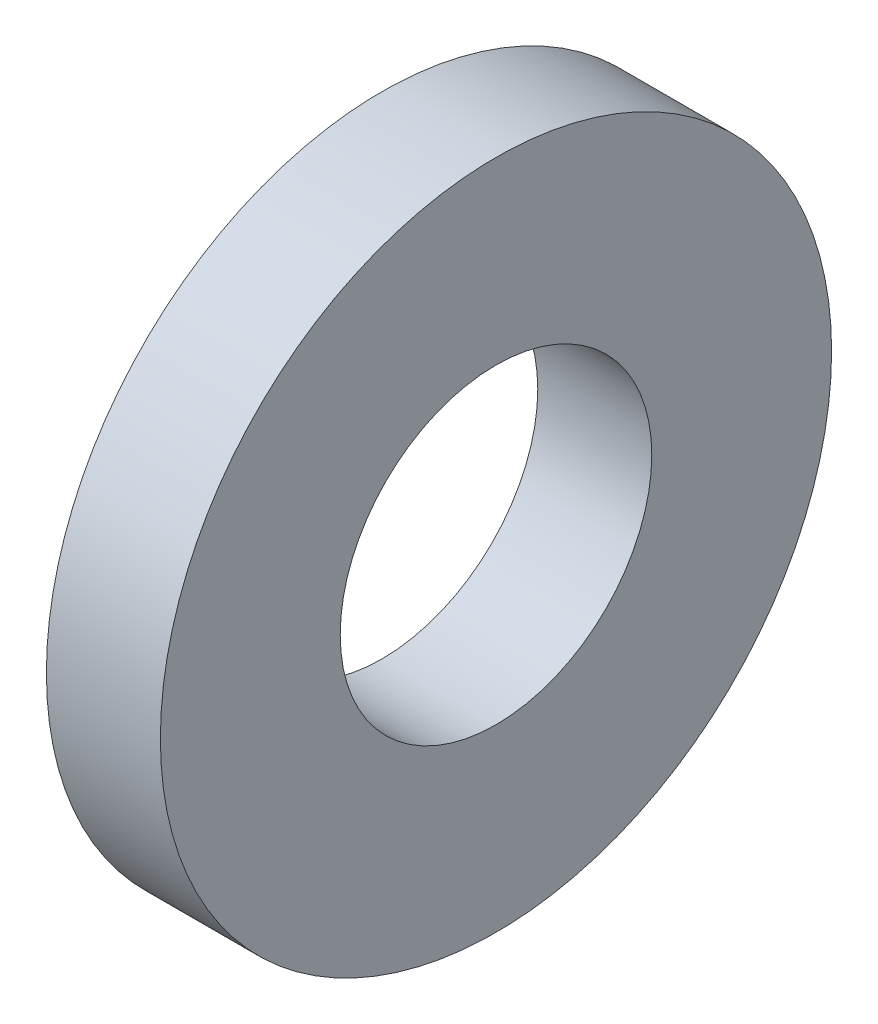
ISO-10303-21;
HEADER;
FILE_DESCRIPTION(('STEP AP214'),'2;1');
FILE_NAME('part.step','',(''),(''),'','','');
FILE_SCHEMA(('AUTOMOTIVE_DESIGN { 1 0 10303 214 1 1 1 1 }'));
ENDSEC;
DATA;
#1=APPLICATION_CONTEXT('core data for automotive mechanical design processes');
#2=APPLICATION_PROTOCOL_DEFINITION('international standard','automotive_design',2000,#1);
#3=PRODUCT_CONTEXT('',#1,'mechanical');
#4=PRODUCT('Part','Part','',(#3));
#5=PRODUCT_RELATED_PRODUCT_CATEGORY('part','',(#4));
#6=PRODUCT_DEFINITION_FORMATION('','',#4);
#7=PRODUCT_DEFINITION_CONTEXT('part definition',#1,'design');
#8=PRODUCT_DEFINITION('design','',#6,#7);
#9=PRODUCT_DEFINITION_SHAPE('','',#8);
#10=(LENGTH_UNIT() NAMED_UNIT(*) SI_UNIT(.MILLI.,.METRE.));
#11=(NAMED_UNIT(*) PLANE_ANGLE_UNIT() SI_UNIT($,.RADIAN.));
#12=(NAMED_UNIT(*) SI_UNIT($,.STERADIAN.) SOLID_ANGLE_UNIT());
#13=UNCERTAINTY_MEASURE_WITH_UNIT(LENGTH_MEASURE(1.E-05),#10,'distance_accuracy_value','');
#14=(GEOMETRIC_REPRESENTATION_CONTEXT(3) GLOBAL_UNCERTAINTY_ASSIGNED_CONTEXT((#13)) GLOBAL_UNIT_ASSIGNED_CONTEXT((#10,
#11,#12)) REPRESENTATION_CONTEXT('',''));
#15=CARTESIAN_POINT('',(0.,0.,0.));
#16=DIRECTION('',(0.,0.,1.));
#17=DIRECTION('',(1.,0.,0.));
#18=AXIS2_PLACEMENT_3D('',#15,#16,#17);
#19=CARTESIAN_POINT('',(-3.,0.,0.));
#20=DIRECTION('',(1.,0.,0.));
#21=DIRECTION('',(0.,0.,-1.));
#22=AXIS2_PLACEMENT_3D('',#19,#20,#21);
#23=CYLINDRICAL_SURFACE('',#22,8.83333333333328);
#24=CARTESIAN_POINT('',(-3.,0.,0.));
#25=DIRECTION('',(1.,0.,0.));
#26=DIRECTION('',(0.,0.,-1.));
#27=AXIS2_PLACEMENT_3D('',#24,#25,#26);
#28=CIRCLE('',#27,8.83333333333328);
#29=CARTESIAN_POINT('',(-3.,0.,-8.83333333333328));
#30=VERTEX_POINT('',#29);
#31=EDGE_CURVE('E10',#30,#30,#28,.T.);
#32=ORIENTED_EDGE('',*,*,#31,.T.);
#33=EDGE_LOOP('',(#32));
#34=FACE_BOUND('',#33,.T.);
#35=CARTESIAN_POINT('',(0.,0.,0.));
#36=DIRECTION('',(1.,0.,0.));
#37=DIRECTION('',(0.,0.,-1.));
#38=AXIS2_PLACEMENT_3D('',#35,#36,#37);
#39=CIRCLE('',#38,8.83333333333328);
#40=CARTESIAN_POINT('',(0.,0.,-8.83333333333328));
#41=VERTEX_POINT('',#40);
#42=EDGE_CURVE('E35',#41,#41,#39,.T.);
#43=ORIENTED_EDGE('',*,*,#42,.F.);
#44=EDGE_LOOP('',(#43));
#45=FACE_BOUND('',#44,.T.);
#46=ADVANCED_FACE('F32',(#34,#45),#23,.T.);
#47=CARTESIAN_POINT('',(-3.,0.,0.));
#48=DIRECTION('',(1.,0.,0.));
#49=DIRECTION('',(0.,0.,-1.));
#50=AXIS2_PLACEMENT_3D('',#47,#48,#49);
#51=PLANE('',#50);
#52=CARTESIAN_POINT('',(-3.,0.,0.));
#53=DIRECTION('',(1.,0.,0.));
#54=DIRECTION('',(0.,0.,-1.));
#55=AXIS2_PLACEMENT_3D('',#52,#53,#54);
#56=CIRCLE('',#55,4.09999999999999);
#57=CARTESIAN_POINT('',(-3.,0.,-4.09999999999999));
#58=VERTEX_POINT('',#57);
#59=EDGE_CURVE('E42',#58,#58,#56,.T.);
#60=ORIENTED_EDGE('',*,*,#59,.T.);
#61=EDGE_LOOP('',(#60));
#62=FACE_BOUND('',#61,.T.);
#63=ORIENTED_EDGE('',*,*,#31,.F.);
#64=EDGE_LOOP('',(#63));
#65=FACE_BOUND('',#64,.T.);
#66=ADVANCED_FACE('F50',(#62,#65),#51,.F.);
#67=CARTESIAN_POINT('',(0.,0.,0.));
#68=DIRECTION('',(1.,0.,0.));
#69=DIRECTION('',(0.,0.,-1.));
#70=AXIS2_PLACEMENT_3D('',#67,#68,#69);
#71=PLANE('',#70);
#72=CARTESIAN_POINT('',(0.,0.,0.));
#73=DIRECTION('',(1.,0.,0.));
#74=DIRECTION('',(0.,0.,-1.));
#75=AXIS2_PLACEMENT_3D('',#72,#73,#74);
#76=CIRCLE('',#75,4.09999999999999);
#77=CARTESIAN_POINT('',(0.,0.,-4.09999999999999));
#78=VERTEX_POINT('',#77);
#79=EDGE_CURVE('E44',#78,#78,#76,.T.);
#80=ORIENTED_EDGE('',*,*,#79,.F.);
#81=EDGE_LOOP('',(#80));
#82=FACE_BOUND('',#81,.T.);
#83=ORIENTED_EDGE('',*,*,#42,.T.);
#84=EDGE_LOOP('',(#83));
#85=FACE_BOUND('',#84,.T.);
#86=ADVANCED_FACE('F56',(#82,#85),#71,.T.);
#87=CARTESIAN_POINT('',(-3.,0.,0.));
#88=DIRECTION('',(1.,0.,0.));
#89=DIRECTION('',(0.,0.,-1.));
#90=AXIS2_PLACEMENT_3D('',#87,#88,#89);
#91=CYLINDRICAL_SURFACE('',#90,4.09999999999999);
#92=ORIENTED_EDGE('',*,*,#59,.F.);
#93=EDGE_LOOP('',(#92));
#94=FACE_BOUND('',#93,.T.);
#95=ORIENTED_EDGE('',*,*,#79,.T.);
#96=EDGE_LOOP('',(#95));
#97=FACE_BOUND('',#96,.T.);
#98=ADVANCED_FACE('F53',(#94,#97),#91,.F.);
#99=CLOSED_SHELL('',(#46,#66,#86,#98));
#100=MANIFOLD_SOLID_BREP('B2',#99);
#101=ADVANCED_BREP_SHAPE_REPRESENTATION('',(#18,#100),#14);
#102=SHAPE_DEFINITION_REPRESENTATION(#9,#101);
ENDSEC;
END-ISO-10303-21;
